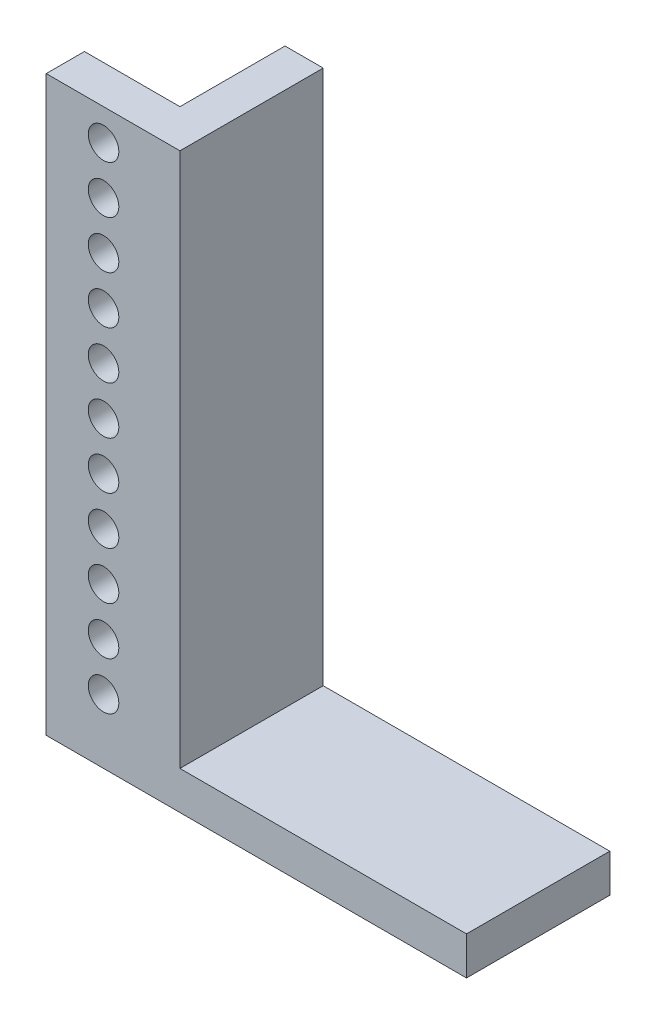
ISO-10303-21;
HEADER;
FILE_DESCRIPTION(('STEP AP214'),'2;1');
FILE_NAME('part.step','',(''),(''),'','','');
FILE_SCHEMA(('AUTOMOTIVE_DESIGN { 1 0 10303 214 1 1 1 1 }'));
ENDSEC;
DATA;
#1=APPLICATION_CONTEXT('core data for automotive mechanical design processes');
#2=APPLICATION_PROTOCOL_DEFINITION('international standard','automotive_design',2000,#1);
#3=PRODUCT_CONTEXT('',#1,'mechanical');
#4=PRODUCT('Part','Part','',(#3));
#5=PRODUCT_RELATED_PRODUCT_CATEGORY('part','',(#4));
#6=PRODUCT_DEFINITION_FORMATION('','',#4);
#7=PRODUCT_DEFINITION_CONTEXT('part definition',#1,'design');
#8=PRODUCT_DEFINITION('design','',#6,#7);
#9=PRODUCT_DEFINITION_SHAPE('','',#8);
#10=(LENGTH_UNIT() NAMED_UNIT(*) SI_UNIT(.MILLI.,.METRE.));
#11=(NAMED_UNIT(*) PLANE_ANGLE_UNIT() SI_UNIT($,.RADIAN.));
#12=(NAMED_UNIT(*) SI_UNIT($,.STERADIAN.) SOLID_ANGLE_UNIT());
#13=UNCERTAINTY_MEASURE_WITH_UNIT(LENGTH_MEASURE(1.E-05),#10,'distance_accuracy_value','');
#14=(GEOMETRIC_REPRESENTATION_CONTEXT(3) GLOBAL_UNCERTAINTY_ASSIGNED_CONTEXT((#13)) GLOBAL_UNIT_ASSIGNED_CONTEXT((#10,
#11,#12)) REPRESENTATION_CONTEXT('',''));
#15=CARTESIAN_POINT('',(0.,0.,0.));
#16=DIRECTION('',(0.,0.,1.));
#17=DIRECTION('',(1.,0.,0.));
#18=AXIS2_PLACEMENT_3D('',#15,#16,#17);
#19=CARTESIAN_POINT('',(-37.2694016200679,16.1797752808989,15.));
#20=DIRECTION('',(1.,0.,0.));
#21=DIRECTION('',(0.,0.,-1.));
#22=AXIS2_PLACEMENT_3D('',#19,#20,#21);
#23=PLANE('',#22);
#24=DIRECTION('',(0.,-1.,0.));
#25=VECTOR('',#24,1.);
#26=CARTESIAN_POINT('',(-37.2694016200679,16.1797752808989,11.));
#27=LINE('',#26,#25);
#28=CARTESIAN_POINT('',(-37.2694016200679,16.1797752808989,11.));
#29=VERTEX_POINT('',#28);
#30=CARTESIAN_POINT('',(-37.2694016200679,-43.8202247191011,11.));
#31=VERTEX_POINT('',#30);
#32=EDGE_CURVE('E56',#29,#31,#27,.T.);
#33=ORIENTED_EDGE('',*,*,#32,.F.);
#34=DIRECTION('',(0.,0.,-1.));
#35=VECTOR('',#34,1.);
#36=CARTESIAN_POINT('',(-37.2694016200679,16.1797752808989,15.));
#37=LINE('',#36,#35);
#38=CARTESIAN_POINT('',(-37.2694016200679,16.1797752808989,0.));
#39=VERTEX_POINT('',#38);
#40=EDGE_CURVE('E88',#29,#39,#37,.T.);
#41=ORIENTED_EDGE('',*,*,#40,.T.);
#42=DIRECTION('',(0.,-1.,0.));
#43=VECTOR('',#42,1.);
#44=CARTESIAN_POINT('',(-37.2694016200679,16.1797752808989,0.));
#45=LINE('',#44,#43);
#46=CARTESIAN_POINT('',(-37.2694016200679,-43.8202247191011,0.));
#47=VERTEX_POINT('',#46);
#48=EDGE_CURVE('E133',#39,#47,#45,.T.);
#49=ORIENTED_EDGE('',*,*,#48,.T.);
#50=DIRECTION('',(0.,0.,-1.));
#51=VECTOR('',#50,1.);
#52=CARTESIAN_POINT('',(-37.2694016200679,-43.8202247191011,15.));
#53=LINE('',#52,#51);
#54=EDGE_CURVE('E11',#31,#47,#53,.T.);
#55=ORIENTED_EDGE('',*,*,#54,.F.);
#56=EDGE_LOOP('',(#33,#41,#49,#55));
#57=FACE_BOUND('',#56,.T.);
#58=ADVANCED_FACE('F39',(#57),#23,.F.);
#59=CARTESIAN_POINT('',(-37.2694016200679,-43.8202247191011,15.));
#60=DIRECTION('',(0.,1.,0.));
#61=DIRECTION('',(0.,0.,1.));
#62=AXIS2_PLACEMENT_3D('',#59,#60,#61);
#63=PLANE('',#62);
#64=DIRECTION('',(1.,0.,0.));
#65=VECTOR('',#64,1.);
#66=CARTESIAN_POINT('',(-37.2694016200679,-43.8202247191011,0.));
#67=LINE('',#66,#65);
#68=CARTESIAN_POINT('',(-3.26940162006794,-43.8202247191011,0.));
#69=VERTEX_POINT('',#68);
#70=EDGE_CURVE('E138',#47,#69,#67,.T.);
#71=ORIENTED_EDGE('',*,*,#70,.T.);
#72=DIRECTION('',(0.,0.,-1.));
#73=VECTOR('',#72,1.);
#74=CARTESIAN_POINT('',(-3.26940162006794,-43.8202247191011,15.));
#75=LINE('',#74,#73);
#76=CARTESIAN_POINT('',(-3.26940162006794,-43.8202247191011,15.));
#77=VERTEX_POINT('',#76);
#78=EDGE_CURVE('E48',#77,#69,#75,.T.);
#79=ORIENTED_EDGE('',*,*,#78,.F.);
#80=DIRECTION('',(1.,0.,0.));
#81=VECTOR('',#80,1.);
#82=CARTESIAN_POINT('',(-37.2694016200679,-43.8202247191011,15.));
#83=LINE('',#82,#81);
#84=CARTESIAN_POINT('',(-47.2694016200679,-43.8202247191011,15.));
#85=VERTEX_POINT('',#84);
#86=EDGE_CURVE('E95',#85,#77,#83,.T.);
#87=ORIENTED_EDGE('',*,*,#86,.F.);
#88=DIRECTION('',(0.,0.,1.));
#89=VECTOR('',#88,1.);
#90=CARTESIAN_POINT('',(-47.2694016200679,-43.8202247191011,11.));
#91=LINE('',#90,#89);
#92=CARTESIAN_POINT('',(-47.2694016200679,-43.8202247191011,11.));
#93=VERTEX_POINT('',#92);
#94=EDGE_CURVE('E111',#93,#85,#91,.T.);
#95=ORIENTED_EDGE('',*,*,#94,.F.);
#96=DIRECTION('',(1.,0.,0.));
#97=VECTOR('',#96,1.);
#98=CARTESIAN_POINT('',(-47.2694016200679,-43.8202247191011,11.));
#99=LINE('',#98,#97);
#100=EDGE_CURVE('E115',#93,#31,#99,.T.);
#101=ORIENTED_EDGE('',*,*,#100,.T.);
#102=ORIENTED_EDGE('',*,*,#54,.T.);
#103=EDGE_LOOP('',(#71,#79,#87,#95,#101,#102));
#104=FACE_BOUND('',#103,.T.);
#105=ADVANCED_FACE('F113',(#104),#63,.F.);
#106=CARTESIAN_POINT('',(-3.26940162006794,-39.8202247191011,15.));
#107=DIRECTION('',(-1.,0.,0.));
#108=DIRECTION('',(0.,0.,1.));
#109=AXIS2_PLACEMENT_3D('',#106,#107,#108);
#110=PLANE('',#109);
#111=DIRECTION('',(0.,1.,0.));
#112=VECTOR('',#111,1.);
#113=CARTESIAN_POINT('',(-3.26940162006794,-39.8202247191011,0.));
#114=LINE('',#113,#112);
#115=CARTESIAN_POINT('',(-3.26940162006794,-39.8202247191011,0.));
#116=VERTEX_POINT('',#115);
#117=EDGE_CURVE('E159',#69,#116,#114,.T.);
#118=ORIENTED_EDGE('',*,*,#117,.T.);
#119=DIRECTION('',(0.,0.,-1.));
#120=VECTOR('',#119,1.);
#121=CARTESIAN_POINT('',(-3.26940162006794,-39.8202247191011,15.));
#122=LINE('',#121,#120);
#123=CARTESIAN_POINT('',(-3.26940162006794,-39.8202247191011,15.));
#124=VERTEX_POINT('',#123);
#125=EDGE_CURVE('E180',#124,#116,#122,.T.);
#126=ORIENTED_EDGE('',*,*,#125,.F.);
#127=DIRECTION('',(0.,1.,0.));
#128=VECTOR('',#127,1.);
#129=CARTESIAN_POINT('',(-3.26940162006794,-39.8202247191011,15.));
#130=LINE('',#129,#128);
#131=EDGE_CURVE('E145',#77,#124,#130,.T.);
#132=ORIENTED_EDGE('',*,*,#131,.F.);
#133=ORIENTED_EDGE('',*,*,#78,.T.);
#134=EDGE_LOOP('',(#118,#126,#132,#133));
#135=FACE_BOUND('',#134,.T.);
#136=ADVANCED_FACE('F305',(#135),#110,.F.);
#137=CARTESIAN_POINT('',(-33.2694016200679,-39.8202247191011,15.));
#138=DIRECTION('',(0.,-1.,0.));
#139=DIRECTION('',(0.,0.,-1.));
#140=AXIS2_PLACEMENT_3D('',#137,#138,#139);
#141=PLANE('',#140);
#142=DIRECTION('',(-1.,0.,0.));
#143=VECTOR('',#142,1.);
#144=CARTESIAN_POINT('',(-33.2694016200679,-39.8202247191011,0.));
#145=LINE('',#144,#143);
#146=CARTESIAN_POINT('',(-33.2694016200679,-39.8202247191011,0.));
#147=VERTEX_POINT('',#146);
#148=EDGE_CURVE('E162',#116,#147,#145,.T.);
#149=ORIENTED_EDGE('',*,*,#148,.T.);
#150=DIRECTION('',(0.,0.,-1.));
#151=VECTOR('',#150,1.);
#152=CARTESIAN_POINT('',(-33.2694016200679,-39.8202247191011,15.));
#153=LINE('',#152,#151);
#154=CARTESIAN_POINT('',(-33.2694016200679,-39.8202247191011,15.));
#155=VERTEX_POINT('',#154);
#156=EDGE_CURVE('E176',#155,#147,#153,.T.);
#157=ORIENTED_EDGE('',*,*,#156,.F.);
#158=DIRECTION('',(-1.,0.,0.));
#159=VECTOR('',#158,1.);
#160=CARTESIAN_POINT('',(-33.2694016200679,-39.8202247191011,15.));
#161=LINE('',#160,#159);
#162=EDGE_CURVE('E149',#124,#155,#161,.T.);
#163=ORIENTED_EDGE('',*,*,#162,.F.);
#164=ORIENTED_EDGE('',*,*,#125,.T.);
#165=EDGE_LOOP('',(#149,#157,#163,#164));
#166=FACE_BOUND('',#165,.T.);
#167=ADVANCED_FACE('F310',(#166),#141,.F.);
#168=CARTESIAN_POINT('',(-33.2694016200679,16.1797752808989,15.));
#169=DIRECTION('',(-1.,0.,0.));
#170=DIRECTION('',(0.,-1.,0.));
#171=AXIS2_PLACEMENT_3D('',#168,#169,#170);
#172=PLANE('',#171);
#173=DIRECTION('',(0.,1.,0.));
#174=VECTOR('',#173,1.);
#175=CARTESIAN_POINT('',(-33.2694016200679,16.1797752808989,0.));
#176=LINE('',#175,#174);
#177=CARTESIAN_POINT('',(-33.2694016200679,16.1797752808989,0.));
#178=VERTEX_POINT('',#177);
#179=EDGE_CURVE('E165',#147,#178,#176,.T.);
#180=ORIENTED_EDGE('',*,*,#179,.T.);
#181=DIRECTION('',(0.,0.,-1.));
#182=VECTOR('',#181,1.);
#183=CARTESIAN_POINT('',(-33.2694016200679,16.1797752808989,15.));
#184=LINE('',#183,#182);
#185=CARTESIAN_POINT('',(-33.2694016200679,16.1797752808989,15.));
#186=VERTEX_POINT('',#185);
#187=EDGE_CURVE('E172',#186,#178,#184,.T.);
#188=ORIENTED_EDGE('',*,*,#187,.F.);
#189=DIRECTION('',(0.,1.,0.));
#190=VECTOR('',#189,1.);
#191=CARTESIAN_POINT('',(-33.2694016200679,16.1797752808989,15.));
#192=LINE('',#191,#190);
#193=EDGE_CURVE('E65',#155,#186,#192,.T.);
#194=ORIENTED_EDGE('',*,*,#193,.F.);
#195=ORIENTED_EDGE('',*,*,#156,.T.);
#196=EDGE_LOOP('',(#180,#188,#194,#195));
#197=FACE_BOUND('',#196,.T.);
#198=ADVANCED_FACE('F313',(#197),#172,.F.);
#199=CARTESIAN_POINT('',(-37.2694016200679,16.1797752808989,15.));
#200=DIRECTION('',(0.,-1.,0.));
#201=DIRECTION('',(0.,0.,-1.));
#202=AXIS2_PLACEMENT_3D('',#199,#200,#201);
#203=PLANE('',#202);
#204=DIRECTION('',(-1.,0.,0.));
#205=VECTOR('',#204,1.);
#206=CARTESIAN_POINT('',(-37.2694016200679,16.1797752808989,0.));
#207=LINE('',#206,#205);
#208=EDGE_CURVE('E146',#178,#39,#207,.T.);
#209=ORIENTED_EDGE('',*,*,#208,.T.);
#210=ORIENTED_EDGE('',*,*,#40,.F.);
#211=DIRECTION('',(1.,0.,0.));
#212=VECTOR('',#211,1.);
#213=CARTESIAN_POINT('',(-47.2694016200679,16.1797752808989,11.));
#214=LINE('',#213,#212);
#215=CARTESIAN_POINT('',(-47.2694016200679,16.1797752808989,11.));
#216=VERTEX_POINT('',#215);
#217=EDGE_CURVE('E134',#216,#29,#214,.T.);
#218=ORIENTED_EDGE('',*,*,#217,.F.);
#219=DIRECTION('',(0.,0.,-1.));
#220=VECTOR('',#219,1.);
#221=CARTESIAN_POINT('',(-47.2694016200679,16.1797752808989,11.));
#222=LINE('',#221,#220);
#223=CARTESIAN_POINT('',(-47.2694016200679,16.1797752808989,15.));
#224=VERTEX_POINT('',#223);
#225=EDGE_CURVE('E125',#224,#216,#222,.T.);
#226=ORIENTED_EDGE('',*,*,#225,.F.);
#227=DIRECTION('',(-1.,0.,0.));
#228=VECTOR('',#227,1.);
#229=CARTESIAN_POINT('',(-37.2694016200679,16.1797752808989,15.));
#230=LINE('',#229,#228);
#231=EDGE_CURVE('E154',#186,#224,#230,.T.);
#232=ORIENTED_EDGE('',*,*,#231,.F.);
#233=ORIENTED_EDGE('',*,*,#187,.T.);
#234=EDGE_LOOP('',(#209,#210,#218,#226,#232,#233));
#235=FACE_BOUND('',#234,.T.);
#236=ADVANCED_FACE('F289',(#235),#203,.F.);
#237=CARTESIAN_POINT('',(0.,0.,15.));
#238=DIRECTION('',(0.,0.,1.));
#239=DIRECTION('',(1.,0.,0.));
#240=AXIS2_PLACEMENT_3D('',#237,#238,#239);
#241=PLANE('',#240);
#242=CARTESIAN_POINT('',(-41.2694016200679,2.90006714155822,15.));
#243=DIRECTION('',(0.,0.,1.));
#244=DIRECTION('',(1.,0.,0.));
#245=AXIS2_PLACEMENT_3D('',#242,#243,#244);
#246=CIRCLE('',#245,1.6);
#247=CARTESIAN_POINT('',(-39.6694016200679,2.90006714155822,15.));
#248=VERTEX_POINT('',#247);
#249=EDGE_CURVE('E241',#248,#248,#246,.T.);
#250=ORIENTED_EDGE('',*,*,#249,.F.);
#251=EDGE_LOOP('',(#250));
#252=FACE_BOUND('',#251,.T.);
#253=CARTESIAN_POINT('',(-41.2694016200679,-2.09993285844177,15.));
#254=DIRECTION('',(0.,0.,1.));
#255=DIRECTION('',(1.,0.,0.));
#256=AXIS2_PLACEMENT_3D('',#253,#254,#255);
#257=CIRCLE('',#256,1.6);
#258=CARTESIAN_POINT('',(-39.6694016200679,-2.09993285844177,15.));
#259=VERTEX_POINT('',#258);
#260=EDGE_CURVE('E267',#259,#259,#257,.T.);
#261=ORIENTED_EDGE('',*,*,#260,.F.);
#262=EDGE_LOOP('',(#261));
#263=FACE_BOUND('',#262,.T.);
#264=CARTESIAN_POINT('',(-41.2694016200679,-7.09993285844178,15.));
#265=DIRECTION('',(0.,0.,1.));
#266=DIRECTION('',(1.,0.,0.));
#267=AXIS2_PLACEMENT_3D('',#264,#265,#266);
#268=CIRCLE('',#267,1.6);
#269=CARTESIAN_POINT('',(-39.6694016200679,-7.09993285844178,15.));
#270=VERTEX_POINT('',#269);
#271=EDGE_CURVE('E263',#270,#270,#268,.T.);
#272=ORIENTED_EDGE('',*,*,#271,.F.);
#273=EDGE_LOOP('',(#272));
#274=FACE_BOUND('',#273,.T.);
#275=CARTESIAN_POINT('',(-41.2694016200679,-12.0999328584418,15.));
#276=DIRECTION('',(0.,0.,1.));
#277=DIRECTION('',(1.,0.,0.));
#278=AXIS2_PLACEMENT_3D('',#275,#276,#277);
#279=CIRCLE('',#278,1.6);
#280=CARTESIAN_POINT('',(-39.6694016200679,-12.0999328584418,15.));
#281=VERTEX_POINT('',#280);
#282=EDGE_CURVE('E259',#281,#281,#279,.T.);
#283=ORIENTED_EDGE('',*,*,#282,.F.);
#284=EDGE_LOOP('',(#283));
#285=FACE_BOUND('',#284,.T.);
#286=CARTESIAN_POINT('',(-41.2694016200679,-17.0999328584418,15.));
#287=DIRECTION('',(0.,0.,1.));
#288=DIRECTION('',(1.,0.,0.));
#289=AXIS2_PLACEMENT_3D('',#286,#287,#288);
#290=CIRCLE('',#289,1.6);
#291=CARTESIAN_POINT('',(-39.6694016200679,-17.0999328584418,15.));
#292=VERTEX_POINT('',#291);
#293=EDGE_CURVE('E255',#292,#292,#290,.T.);
#294=ORIENTED_EDGE('',*,*,#293,.F.);
#295=EDGE_LOOP('',(#294));
#296=FACE_BOUND('',#295,.T.);
#297=CARTESIAN_POINT('',(-41.2694016200679,-22.0999328584418,15.));
#298=DIRECTION('',(0.,0.,1.));
#299=DIRECTION('',(1.,0.,0.));
#300=AXIS2_PLACEMENT_3D('',#297,#298,#299);
#301=CIRCLE('',#300,1.6);
#302=CARTESIAN_POINT('',(-39.6694016200679,-22.0999328584418,15.));
#303=VERTEX_POINT('',#302);
#304=EDGE_CURVE('E251',#303,#303,#301,.T.);
#305=ORIENTED_EDGE('',*,*,#304,.F.);
#306=EDGE_LOOP('',(#305));
#307=FACE_BOUND('',#306,.T.);
#308=CARTESIAN_POINT('',(-41.2694016200679,-27.0999328584418,15.));
#309=DIRECTION('',(0.,0.,1.));
#310=DIRECTION('',(1.,0.,0.));
#311=AXIS2_PLACEMENT_3D('',#308,#309,#310);
#312=CIRCLE('',#311,1.6);
#313=CARTESIAN_POINT('',(-39.6694016200679,-27.0999328584418,15.));
#314=VERTEX_POINT('',#313);
#315=EDGE_CURVE('E246',#314,#314,#312,.T.);
#316=ORIENTED_EDGE('',*,*,#315,.F.);
#317=EDGE_LOOP('',(#316));
#318=FACE_BOUND('',#317,.T.);
#319=CARTESIAN_POINT('',(-41.2694016200679,-32.0999328584418,15.));
#320=DIRECTION('',(0.,0.,1.));
#321=DIRECTION('',(1.,0.,0.));
#322=AXIS2_PLACEMENT_3D('',#319,#320,#321);
#323=CIRCLE('',#322,1.6);
#324=CARTESIAN_POINT('',(-39.6694016200679,-32.0999328584418,15.));
#325=VERTEX_POINT('',#324);
#326=EDGE_CURVE('E242',#325,#325,#323,.T.);
#327=ORIENTED_EDGE('',*,*,#326,.F.);
#328=EDGE_LOOP('',(#327));
#329=FACE_BOUND('',#328,.T.);
#330=CARTESIAN_POINT('',(-41.2694016200679,-37.0999328584418,15.));
#331=DIRECTION('',(0.,0.,1.));
#332=DIRECTION('',(1.,0.,0.));
#333=AXIS2_PLACEMENT_3D('',#330,#331,#332);
#334=CIRCLE('',#333,1.6);
#335=CARTESIAN_POINT('',(-39.6694016200679,-37.0999328584418,15.));
#336=VERTEX_POINT('',#335);
#337=EDGE_CURVE('E247',#336,#336,#334,.T.);
#338=ORIENTED_EDGE('',*,*,#337,.F.);
#339=EDGE_LOOP('',(#338));
#340=FACE_BOUND('',#339,.T.);
#341=CARTESIAN_POINT('',(-41.2694016200679,12.9000671415582,15.));
#342=DIRECTION('',(0.,0.,1.));
#343=DIRECTION('',(1.,0.,0.));
#344=AXIS2_PLACEMENT_3D('',#341,#342,#343);
#345=CIRCLE('',#344,1.6);
#346=CARTESIAN_POINT('',(-39.669401620068,12.9000671415582,15.));
#347=VERTEX_POINT('',#346);
#348=EDGE_CURVE('E274',#347,#347,#345,.T.);
#349=ORIENTED_EDGE('',*,*,#348,.F.);
#350=EDGE_LOOP('',(#349));
#351=FACE_BOUND('',#350,.T.);
#352=CARTESIAN_POINT('',(-41.2694016200679,7.90006714155822,15.));
#353=DIRECTION('',(0.,0.,1.));
#354=DIRECTION('',(1.,0.,0.));
#355=AXIS2_PLACEMENT_3D('',#352,#353,#354);
#356=CIRCLE('',#355,1.6);
#357=CARTESIAN_POINT('',(-39.6694016200679,7.90006714155822,15.));
#358=VERTEX_POINT('',#357);
#359=EDGE_CURVE('E192',#358,#358,#356,.T.);
#360=ORIENTED_EDGE('',*,*,#359,.F.);
#361=EDGE_LOOP('',(#360));
#362=FACE_BOUND('',#361,.T.);
#363=ORIENTED_EDGE('',*,*,#231,.T.);
#364=DIRECTION('',(0.,1.,0.));
#365=VECTOR('',#364,1.);
#366=CARTESIAN_POINT('',(-47.2694016200679,16.1797752808989,15.));
#367=LINE('',#366,#365);
#368=EDGE_CURVE('E119',#85,#224,#367,.T.);
#369=ORIENTED_EDGE('',*,*,#368,.F.);
#370=ORIENTED_EDGE('',*,*,#86,.T.);
#371=ORIENTED_EDGE('',*,*,#131,.T.);
#372=ORIENTED_EDGE('',*,*,#162,.T.);
#373=ORIENTED_EDGE('',*,*,#193,.T.);
#374=EDGE_LOOP('',(#363,#369,#370,#371,#372,#373));
#375=FACE_BOUND('',#374,.T.);
#376=ADVANCED_FACE('F285',(#252,#263,#274,#285,#296,#307,#318,#329,#340,#351,#362,#375),#241,.T.);
#377=CARTESIAN_POINT('',(0.,0.,0.));
#378=DIRECTION('',(0.,0.,1.));
#379=DIRECTION('',(1.,0.,0.));
#380=AXIS2_PLACEMENT_3D('',#377,#378,#379);
#381=PLANE('',#380);
#382=ORIENTED_EDGE('',*,*,#48,.F.);
#383=ORIENTED_EDGE('',*,*,#208,.F.);
#384=ORIENTED_EDGE('',*,*,#179,.F.);
#385=ORIENTED_EDGE('',*,*,#148,.F.);
#386=ORIENTED_EDGE('',*,*,#117,.F.);
#387=ORIENTED_EDGE('',*,*,#70,.F.);
#388=EDGE_LOOP('',(#382,#383,#384,#385,#386,#387));
#389=FACE_BOUND('',#388,.T.);
#390=ADVANCED_FACE('F288',(#389),#381,.F.);
#391=CARTESIAN_POINT('',(-47.2694016200679,16.1797752808989,11.));
#392=DIRECTION('',(0.,0.,1.));
#393=DIRECTION('',(0.,-1.,0.));
#394=AXIS2_PLACEMENT_3D('',#391,#392,#393);
#395=PLANE('',#394);
#396=CARTESIAN_POINT('',(-41.2694016200679,2.90006714155822,11.));
#397=DIRECTION('',(0.,0.,1.));
#398=DIRECTION('',(0.,-1.,0.));
#399=AXIS2_PLACEMENT_3D('',#396,#397,#398);
#400=CIRCLE('',#399,1.6);
#401=CARTESIAN_POINT('',(-41.2694016200679,1.30006714155823,11.));
#402=VERTEX_POINT('',#401);
#403=EDGE_CURVE('E42',#402,#402,#400,.T.);
#404=ORIENTED_EDGE('',*,*,#403,.T.);
#405=EDGE_LOOP('',(#404));
#406=FACE_BOUND('',#405,.T.);
#407=CARTESIAN_POINT('',(-41.2694016200679,-2.09993285844177,11.));
#408=DIRECTION('',(0.,0.,1.));
#409=DIRECTION('',(0.,-1.,0.));
#410=AXIS2_PLACEMENT_3D('',#407,#408,#409);
#411=CIRCLE('',#410,1.6);
#412=CARTESIAN_POINT('',(-41.2694016200679,-3.69993285844177,11.));
#413=VERTEX_POINT('',#412);
#414=EDGE_CURVE('E223',#413,#413,#411,.T.);
#415=ORIENTED_EDGE('',*,*,#414,.T.);
#416=EDGE_LOOP('',(#415));
#417=FACE_BOUND('',#416,.T.);
#418=CARTESIAN_POINT('',(-41.2694016200679,-7.09993285844178,11.));
#419=DIRECTION('',(0.,0.,1.));
#420=DIRECTION('',(0.,-1.,0.));
#421=AXIS2_PLACEMENT_3D('',#418,#419,#420);
#422=CIRCLE('',#421,1.6);
#423=CARTESIAN_POINT('',(-41.2694016200679,-8.69993285844177,11.));
#424=VERTEX_POINT('',#423);
#425=EDGE_CURVE('E220',#424,#424,#422,.T.);
#426=ORIENTED_EDGE('',*,*,#425,.T.);
#427=EDGE_LOOP('',(#426));
#428=FACE_BOUND('',#427,.T.);
#429=CARTESIAN_POINT('',(-41.2694016200679,-12.0999328584418,11.));
#430=DIRECTION('',(0.,0.,1.));
#431=DIRECTION('',(0.,-1.,0.));
#432=AXIS2_PLACEMENT_3D('',#429,#430,#431);
#433=CIRCLE('',#432,1.6);
#434=CARTESIAN_POINT('',(-41.2694016200679,-13.6999328584418,11.));
#435=VERTEX_POINT('',#434);
#436=EDGE_CURVE('E216',#435,#435,#433,.T.);
#437=ORIENTED_EDGE('',*,*,#436,.T.);
#438=EDGE_LOOP('',(#437));
#439=FACE_BOUND('',#438,.T.);
#440=CARTESIAN_POINT('',(-41.2694016200679,-17.0999328584418,11.));
#441=DIRECTION('',(0.,0.,1.));
#442=DIRECTION('',(0.,-1.,0.));
#443=AXIS2_PLACEMENT_3D('',#440,#441,#442);
#444=CIRCLE('',#443,1.6);
#445=CARTESIAN_POINT('',(-41.2694016200679,-18.6999328584418,11.));
#446=VERTEX_POINT('',#445);
#447=EDGE_CURVE('E212',#446,#446,#444,.T.);
#448=ORIENTED_EDGE('',*,*,#447,.T.);
#449=EDGE_LOOP('',(#448));
#450=FACE_BOUND('',#449,.T.);
#451=CARTESIAN_POINT('',(-41.2694016200679,-22.0999328584418,11.));
#452=DIRECTION('',(0.,0.,1.));
#453=DIRECTION('',(0.,-1.,0.));
#454=AXIS2_PLACEMENT_3D('',#451,#452,#453);
#455=CIRCLE('',#454,1.6);
#456=CARTESIAN_POINT('',(-41.2694016200679,-23.6999328584418,11.));
#457=VERTEX_POINT('',#456);
#458=EDGE_CURVE('E208',#457,#457,#455,.T.);
#459=ORIENTED_EDGE('',*,*,#458,.T.);
#460=EDGE_LOOP('',(#459));
#461=FACE_BOUND('',#460,.T.);
#462=CARTESIAN_POINT('',(-41.2694016200679,-27.0999328584418,11.));
#463=DIRECTION('',(0.,0.,1.));
#464=DIRECTION('',(0.,-1.,0.));
#465=AXIS2_PLACEMENT_3D('',#462,#463,#464);
#466=CIRCLE('',#465,1.6);
#467=CARTESIAN_POINT('',(-41.2694016200679,-28.6999328584418,11.));
#468=VERTEX_POINT('',#467);
#469=EDGE_CURVE('E204',#468,#468,#466,.T.);
#470=ORIENTED_EDGE('',*,*,#469,.T.);
#471=EDGE_LOOP('',(#470));
#472=FACE_BOUND('',#471,.T.);
#473=CARTESIAN_POINT('',(-41.2694016200679,-32.0999328584418,11.));
#474=DIRECTION('',(0.,0.,1.));
#475=DIRECTION('',(0.,-1.,0.));
#476=AXIS2_PLACEMENT_3D('',#473,#474,#475);
#477=CIRCLE('',#476,1.6);
#478=CARTESIAN_POINT('',(-41.2694016200679,-33.6999328584418,11.));
#479=VERTEX_POINT('',#478);
#480=EDGE_CURVE('E200',#479,#479,#477,.T.);
#481=ORIENTED_EDGE('',*,*,#480,.T.);
#482=EDGE_LOOP('',(#481));
#483=FACE_BOUND('',#482,.T.);
#484=CARTESIAN_POINT('',(-41.2694016200679,-37.0999328584418,11.));
#485=DIRECTION('',(0.,0.,1.));
#486=DIRECTION('',(0.,-1.,0.));
#487=AXIS2_PLACEMENT_3D('',#484,#485,#486);
#488=CIRCLE('',#487,1.6);
#489=CARTESIAN_POINT('',(-41.2694016200679,-38.6999328584418,11.));
#490=VERTEX_POINT('',#489);
#491=EDGE_CURVE('E196',#490,#490,#488,.T.);
#492=ORIENTED_EDGE('',*,*,#491,.T.);
#493=EDGE_LOOP('',(#492));
#494=FACE_BOUND('',#493,.T.);
#495=CARTESIAN_POINT('',(-41.2694016200679,12.9000671415582,11.));
#496=DIRECTION('',(0.,0.,1.));
#497=DIRECTION('',(0.,-1.,0.));
#498=AXIS2_PLACEMENT_3D('',#495,#496,#497);
#499=CIRCLE('',#498,1.6);
#500=CARTESIAN_POINT('',(-41.2694016200679,11.3000671415582,11.));
#501=VERTEX_POINT('',#500);
#502=EDGE_CURVE('E191',#501,#501,#499,.T.);
#503=ORIENTED_EDGE('',*,*,#502,.T.);
#504=EDGE_LOOP('',(#503));
#505=FACE_BOUND('',#504,.T.);
#506=CARTESIAN_POINT('',(-41.2694016200679,7.90006714155822,11.));
#507=DIRECTION('',(0.,0.,1.));
#508=DIRECTION('',(0.,-1.,0.));
#509=AXIS2_PLACEMENT_3D('',#506,#507,#508);
#510=CIRCLE('',#509,1.6);
#511=CARTESIAN_POINT('',(-41.2694016200679,6.30006714155823,11.));
#512=VERTEX_POINT('',#511);
#513=EDGE_CURVE('E187',#512,#512,#510,.T.);
#514=ORIENTED_EDGE('',*,*,#513,.T.);
#515=EDGE_LOOP('',(#514));
#516=FACE_BOUND('',#515,.T.);
#517=ORIENTED_EDGE('',*,*,#32,.T.);
#518=ORIENTED_EDGE('',*,*,#100,.F.);
#519=DIRECTION('',(0.,-1.,0.));
#520=VECTOR('',#519,1.);
#521=CARTESIAN_POINT('',(-47.2694016200679,16.1797752808989,11.));
#522=LINE('',#521,#520);
#523=EDGE_CURVE('E120',#216,#93,#522,.T.);
#524=ORIENTED_EDGE('',*,*,#523,.F.);
#525=ORIENTED_EDGE('',*,*,#217,.T.);
#526=EDGE_LOOP('',(#517,#518,#524,#525));
#527=FACE_BOUND('',#526,.T.);
#528=ADVANCED_FACE('F131',(#406,#417,#428,#439,#450,#461,#472,#483,#494,#505,#516,#527),#395,.F.);
#529=CARTESIAN_POINT('',(-47.2694016200679,0.,0.));
#530=DIRECTION('',(-1.,0.,0.));
#531=DIRECTION('',(0.,0.,1.));
#532=AXIS2_PLACEMENT_3D('',#529,#530,#531);
#533=PLANE('',#532);
#534=ORIENTED_EDGE('',*,*,#523,.T.);
#535=ORIENTED_EDGE('',*,*,#94,.T.);
#536=ORIENTED_EDGE('',*,*,#368,.T.);
#537=ORIENTED_EDGE('',*,*,#225,.T.);
#538=EDGE_LOOP('',(#534,#535,#536,#537));
#539=FACE_BOUND('',#538,.T.);
#540=ADVANCED_FACE('F123',(#539),#533,.T.);
#541=CARTESIAN_POINT('',(-41.2694016200679,7.90006714155822,9.));
#542=DIRECTION('',(0.,0.,1.));
#543=DIRECTION('',(1.,0.,0.));
#544=AXIS2_PLACEMENT_3D('',#541,#542,#543);
#545=CYLINDRICAL_SURFACE('',#544,1.6);
#546=ORIENTED_EDGE('',*,*,#359,.T.);
#547=EDGE_LOOP('',(#546));
#548=FACE_BOUND('',#547,.T.);
#549=ORIENTED_EDGE('',*,*,#513,.F.);
#550=EDGE_LOOP('',(#549));
#551=FACE_BOUND('',#550,.T.);
#552=ADVANCED_FACE('F376',(#548,#551),#545,.F.);
#553=CARTESIAN_POINT('',(-41.2694016200679,12.9000671415582,9.));
#554=DIRECTION('',(0.,0.,1.));
#555=DIRECTION('',(1.,0.,0.));
#556=AXIS2_PLACEMENT_3D('',#553,#554,#555);
#557=CYLINDRICAL_SURFACE('',#556,1.6);
#558=ORIENTED_EDGE('',*,*,#348,.T.);
#559=EDGE_LOOP('',(#558));
#560=FACE_BOUND('',#559,.T.);
#561=ORIENTED_EDGE('',*,*,#502,.F.);
#562=EDGE_LOOP('',(#561));
#563=FACE_BOUND('',#562,.T.);
#564=ADVANCED_FACE('F397',(#560,#563),#557,.F.);
#565=CARTESIAN_POINT('',(-41.2694016200679,-37.0999328584418,9.));
#566=DIRECTION('',(0.,0.,1.));
#567=DIRECTION('',(1.,0.,0.));
#568=AXIS2_PLACEMENT_3D('',#565,#566,#567);
#569=CYLINDRICAL_SURFACE('',#568,1.6);
#570=ORIENTED_EDGE('',*,*,#337,.T.);
#571=EDGE_LOOP('',(#570));
#572=FACE_BOUND('',#571,.T.);
#573=ORIENTED_EDGE('',*,*,#491,.F.);
#574=EDGE_LOOP('',(#573));
#575=FACE_BOUND('',#574,.T.);
#576=ADVANCED_FACE('F282',(#572,#575),#569,.F.);
#577=CARTESIAN_POINT('',(-41.2694016200679,-32.0999328584418,9.));
#578=DIRECTION('',(0.,0.,1.));
#579=DIRECTION('',(1.,0.,0.));
#580=AXIS2_PLACEMENT_3D('',#577,#578,#579);
#581=CYLINDRICAL_SURFACE('',#580,1.6);
#582=ORIENTED_EDGE('',*,*,#326,.T.);
#583=EDGE_LOOP('',(#582));
#584=FACE_BOUND('',#583,.T.);
#585=ORIENTED_EDGE('',*,*,#480,.F.);
#586=EDGE_LOOP('',(#585));
#587=FACE_BOUND('',#586,.T.);
#588=ADVANCED_FACE('F416',(#584,#587),#581,.F.);
#589=CARTESIAN_POINT('',(-41.2694016200679,-27.0999328584418,9.));
#590=DIRECTION('',(0.,0.,1.));
#591=DIRECTION('',(1.,0.,0.));
#592=AXIS2_PLACEMENT_3D('',#589,#590,#591);
#593=CYLINDRICAL_SURFACE('',#592,1.6);
#594=ORIENTED_EDGE('',*,*,#315,.T.);
#595=EDGE_LOOP('',(#594));
#596=FACE_BOUND('',#595,.T.);
#597=ORIENTED_EDGE('',*,*,#469,.F.);
#598=EDGE_LOOP('',(#597));
#599=FACE_BOUND('',#598,.T.);
#600=ADVANCED_FACE('F425',(#596,#599),#593,.F.);
#601=CARTESIAN_POINT('',(-41.2694016200679,-22.0999328584418,9.));
#602=DIRECTION('',(0.,0.,1.));
#603=DIRECTION('',(1.,0.,0.));
#604=AXIS2_PLACEMENT_3D('',#601,#602,#603);
#605=CYLINDRICAL_SURFACE('',#604,1.6);
#606=ORIENTED_EDGE('',*,*,#304,.T.);
#607=EDGE_LOOP('',(#606));
#608=FACE_BOUND('',#607,.T.);
#609=ORIENTED_EDGE('',*,*,#458,.F.);
#610=EDGE_LOOP('',(#609));
#611=FACE_BOUND('',#610,.T.);
#612=ADVANCED_FACE('F435',(#608,#611),#605,.F.);
#613=CARTESIAN_POINT('',(-41.2694016200679,-17.0999328584418,9.));
#614=DIRECTION('',(0.,0.,1.));
#615=DIRECTION('',(1.,0.,0.));
#616=AXIS2_PLACEMENT_3D('',#613,#614,#615);
#617=CYLINDRICAL_SURFACE('',#616,1.6);
#618=ORIENTED_EDGE('',*,*,#293,.T.);
#619=EDGE_LOOP('',(#618));
#620=FACE_BOUND('',#619,.T.);
#621=ORIENTED_EDGE('',*,*,#447,.F.);
#622=EDGE_LOOP('',(#621));
#623=FACE_BOUND('',#622,.T.);
#624=ADVANCED_FACE('F445',(#620,#623),#617,.F.);
#625=CARTESIAN_POINT('',(-41.2694016200679,-12.0999328584418,9.));
#626=DIRECTION('',(0.,0.,1.));
#627=DIRECTION('',(1.,0.,0.));
#628=AXIS2_PLACEMENT_3D('',#625,#626,#627);
#629=CYLINDRICAL_SURFACE('',#628,1.6);
#630=ORIENTED_EDGE('',*,*,#282,.T.);
#631=EDGE_LOOP('',(#630));
#632=FACE_BOUND('',#631,.T.);
#633=ORIENTED_EDGE('',*,*,#436,.F.);
#634=EDGE_LOOP('',(#633));
#635=FACE_BOUND('',#634,.T.);
#636=ADVANCED_FACE('F455',(#632,#635),#629,.F.);
#637=CARTESIAN_POINT('',(-41.2694016200679,-7.09993285844178,9.));
#638=DIRECTION('',(0.,0.,1.));
#639=DIRECTION('',(1.,0.,0.));
#640=AXIS2_PLACEMENT_3D('',#637,#638,#639);
#641=CYLINDRICAL_SURFACE('',#640,1.6);
#642=ORIENTED_EDGE('',*,*,#271,.T.);
#643=EDGE_LOOP('',(#642));
#644=FACE_BOUND('',#643,.T.);
#645=ORIENTED_EDGE('',*,*,#425,.F.);
#646=EDGE_LOOP('',(#645));
#647=FACE_BOUND('',#646,.T.);
#648=ADVANCED_FACE('F465',(#644,#647),#641,.F.);
#649=CARTESIAN_POINT('',(-41.2694016200679,-2.09993285844177,9.));
#650=DIRECTION('',(0.,0.,1.));
#651=DIRECTION('',(1.,0.,0.));
#652=AXIS2_PLACEMENT_3D('',#649,#650,#651);
#653=CYLINDRICAL_SURFACE('',#652,1.6);
#654=ORIENTED_EDGE('',*,*,#260,.T.);
#655=EDGE_LOOP('',(#654));
#656=FACE_BOUND('',#655,.T.);
#657=ORIENTED_EDGE('',*,*,#414,.F.);
#658=EDGE_LOOP('',(#657));
#659=FACE_BOUND('',#658,.T.);
#660=ADVANCED_FACE('F475',(#656,#659),#653,.F.);
#661=CARTESIAN_POINT('',(-41.2694016200679,2.90006714155822,9.));
#662=DIRECTION('',(0.,0.,1.));
#663=DIRECTION('',(1.,0.,0.));
#664=AXIS2_PLACEMENT_3D('',#661,#662,#663);
#665=CYLINDRICAL_SURFACE('',#664,1.6);
#666=ORIENTED_EDGE('',*,*,#249,.T.);
#667=EDGE_LOOP('',(#666));
#668=FACE_BOUND('',#667,.T.);
#669=ORIENTED_EDGE('',*,*,#403,.F.);
#670=EDGE_LOOP('',(#669));
#671=FACE_BOUND('',#670,.T.);
#672=ADVANCED_FACE('F485',(#668,#671),#665,.F.);
#673=CLOSED_SHELL('',(#58,#105,#136,#167,#198,#236,#376,#390,#528,#540,#552,#564,#576,#588,#600,
#612,#624,#636,#648,#660,#672));
#674=MANIFOLD_SOLID_BREP('B2',#673);
#675=ADVANCED_BREP_SHAPE_REPRESENTATION('',(#18,#674),#14);
#676=SHAPE_DEFINITION_REPRESENTATION(#9,#675);
ENDSEC;
END-ISO-10303-21;
